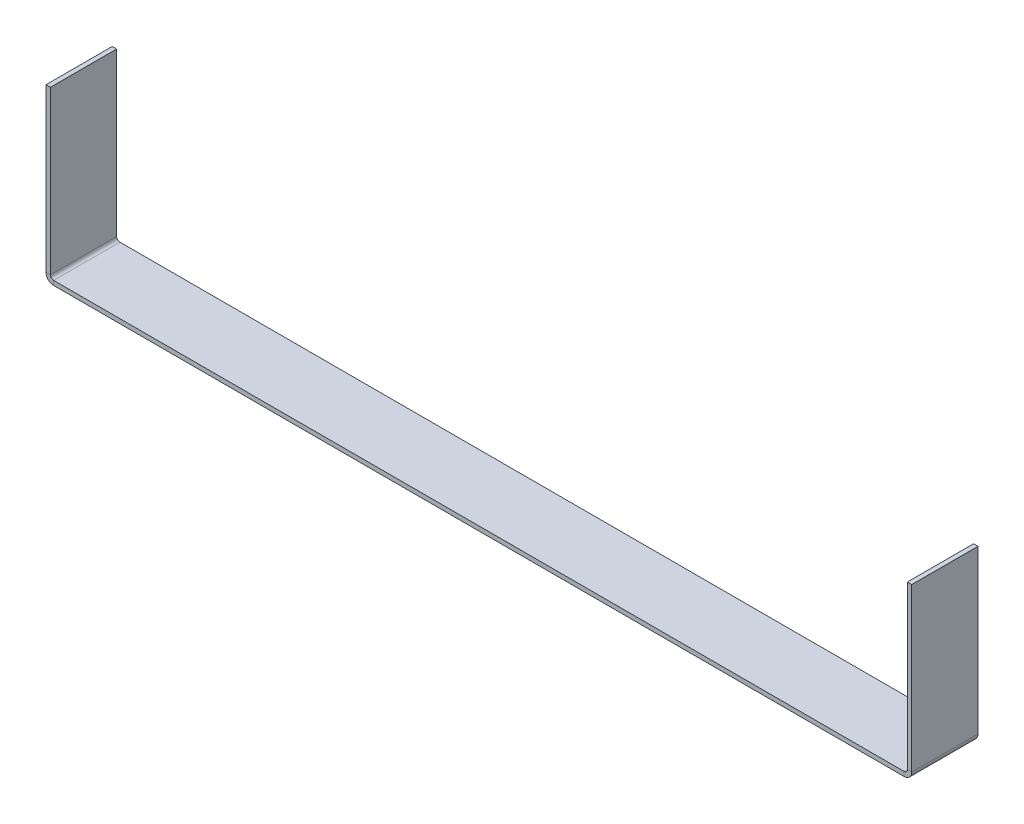
ISO-10303-21;
HEADER;
FILE_DESCRIPTION(('STEP AP214'),'2;1');
FILE_NAME('part.step','',(''),(''),'','','');
FILE_SCHEMA(('AUTOMOTIVE_DESIGN { 1 0 10303 214 1 1 1 1 }'));
ENDSEC;
DATA;
#1=APPLICATION_CONTEXT('core data for automotive mechanical design processes');
#2=APPLICATION_PROTOCOL_DEFINITION('international standard','automotive_design',2000,#1);
#3=PRODUCT_CONTEXT('',#1,'mechanical');
#4=PRODUCT('Part','Part','',(#3));
#5=PRODUCT_RELATED_PRODUCT_CATEGORY('part','',(#4));
#6=PRODUCT_DEFINITION_FORMATION('','',#4);
#7=PRODUCT_DEFINITION_CONTEXT('part definition',#1,'design');
#8=PRODUCT_DEFINITION('design','',#6,#7);
#9=PRODUCT_DEFINITION_SHAPE('','',#8);
#10=(LENGTH_UNIT() NAMED_UNIT(*) SI_UNIT(.MILLI.,.METRE.));
#11=(NAMED_UNIT(*) PLANE_ANGLE_UNIT() SI_UNIT($,.RADIAN.));
#12=(NAMED_UNIT(*) SI_UNIT($,.STERADIAN.) SOLID_ANGLE_UNIT());
#13=UNCERTAINTY_MEASURE_WITH_UNIT(LENGTH_MEASURE(1.E-05),#10,'distance_accuracy_value','');
#14=(GEOMETRIC_REPRESENTATION_CONTEXT(3) GLOBAL_UNCERTAINTY_ASSIGNED_CONTEXT((#13)) GLOBAL_UNIT_ASSIGNED_CONTEXT((#10,
#11,#12)) REPRESENTATION_CONTEXT('',''));
#15=CARTESIAN_POINT('',(0.,0.,0.));
#16=DIRECTION('',(0.,0.,1.));
#17=DIRECTION('',(1.,0.,0.));
#18=AXIS2_PLACEMENT_3D('',#15,#16,#17);
#19=CARTESIAN_POINT('',(0.,-1.,-15.));
#20=DIRECTION('',(0.,0.,1.));
#21=DIRECTION('',(1.,0.,0.));
#22=AXIS2_PLACEMENT_3D('',#19,#20,#21);
#23=PLANE('',#22);
#24=DIRECTION('',(0.,-1.,0.));
#25=VECTOR('',#24,1.);
#26=CARTESIAN_POINT('',(194.2634,0.,-15.));
#27=LINE('',#26,#25);
#28=CARTESIAN_POINT('',(194.2634,0.,-15.));
#29=VERTEX_POINT('',#28);
#30=CARTESIAN_POINT('',(194.2634,-0.999999999999997,-15.));
#31=VERTEX_POINT('',#30);
#32=EDGE_CURVE('E217',#29,#31,#27,.T.);
#33=ORIENTED_EDGE('',*,*,#32,.T.);
#34=DIRECTION('',(1.,0.,0.));
#35=VECTOR('',#34,1.);
#36=CARTESIAN_POINT('',(0.,-1.,-15.));
#37=LINE('',#36,#35);
#38=CARTESIAN_POINT('',(1.7366,-1.,-15.));
#39=VERTEX_POINT('',#38);
#40=EDGE_CURVE('E86',#39,#31,#37,.T.);
#41=ORIENTED_EDGE('',*,*,#40,.F.);
#42=DIRECTION('',(0.,-1.,0.));
#43=VECTOR('',#42,1.);
#44=CARTESIAN_POINT('',(1.7366,0.,-15.));
#45=LINE('',#44,#43);
#46=CARTESIAN_POINT('',(1.7366,0.,-15.));
#47=VERTEX_POINT('',#46);
#48=EDGE_CURVE('E278',#47,#39,#45,.T.);
#49=ORIENTED_EDGE('',*,*,#48,.F.);
#50=DIRECTION('',(1.,0.,0.));
#51=VECTOR('',#50,1.);
#52=CARTESIAN_POINT('',(0.,0.,-15.));
#53=LINE('',#52,#51);
#54=EDGE_CURVE('E281',#47,#29,#53,.T.);
#55=ORIENTED_EDGE('',*,*,#54,.T.);
#56=EDGE_LOOP('',(#33,#41,#49,#55));
#57=FACE_BOUND('',#56,.T.);
#58=ADVANCED_FACE('F78',(#57),#23,.F.);
#59=CARTESIAN_POINT('',(0.,-1.,0.));
#60=DIRECTION('',(0.,1.,0.));
#61=DIRECTION('',(0.,0.,1.));
#62=AXIS2_PLACEMENT_3D('',#59,#60,#61);
#63=PLANE('',#62);
#64=DIRECTION('',(0.,0.,-1.));
#65=VECTOR('',#64,1.);
#66=CARTESIAN_POINT('',(194.2634,-0.999999999999997,-15.));
#67=LINE('',#66,#65);
#68=CARTESIAN_POINT('',(194.2634,-1.,0.));
#69=VERTEX_POINT('',#68);
#70=EDGE_CURVE('E211',#31,#69,#67,.F.);
#71=ORIENTED_EDGE('',*,*,#70,.T.);
#72=DIRECTION('',(1.,0.,0.));
#73=VECTOR('',#72,1.);
#74=CARTESIAN_POINT('',(0.,-1.,0.));
#75=LINE('',#74,#73);
#76=CARTESIAN_POINT('',(1.7366,-1.,0.));
#77=VERTEX_POINT('',#76);
#78=EDGE_CURVE('E13',#77,#69,#75,.T.);
#79=ORIENTED_EDGE('',*,*,#78,.F.);
#80=DIRECTION('',(0.,0.,1.));
#81=VECTOR('',#80,1.);
#82=CARTESIAN_POINT('',(1.7366,-1.,0.));
#83=LINE('',#82,#81);
#84=EDGE_CURVE('E263',#77,#39,#83,.F.);
#85=ORIENTED_EDGE('',*,*,#84,.T.);
#86=ORIENTED_EDGE('',*,*,#40,.T.);
#87=EDGE_LOOP('',(#71,#79,#85,#86));
#88=FACE_BOUND('',#87,.T.);
#89=ADVANCED_FACE('F350',(#88),#63,.F.);
#90=CARTESIAN_POINT('',(0.,0.,0.));
#91=DIRECTION('',(0.,1.,0.));
#92=DIRECTION('',(0.,0.,1.));
#93=AXIS2_PLACEMENT_3D('',#90,#91,#92);
#94=PLANE('',#93);
#95=DIRECTION('',(1.,0.,0.));
#96=VECTOR('',#95,1.);
#97=CARTESIAN_POINT('',(0.,0.,0.));
#98=LINE('',#97,#96);
#99=CARTESIAN_POINT('',(1.7366,0.,0.));
#100=VERTEX_POINT('',#99);
#101=CARTESIAN_POINT('',(194.2634,0.,0.));
#102=VERTEX_POINT('',#101);
#103=EDGE_CURVE('E81',#100,#102,#98,.T.);
#104=ORIENTED_EDGE('',*,*,#103,.T.);
#105=DIRECTION('',(0.,0.,-1.));
#106=VECTOR('',#105,1.);
#107=CARTESIAN_POINT('',(194.2634,0.,-15.));
#108=LINE('',#107,#106);
#109=EDGE_CURVE('E94',#29,#102,#108,.F.);
#110=ORIENTED_EDGE('',*,*,#109,.F.);
#111=ORIENTED_EDGE('',*,*,#54,.F.);
#112=DIRECTION('',(0.,0.,1.));
#113=VECTOR('',#112,1.);
#114=CARTESIAN_POINT('',(1.7366,0.,0.));
#115=LINE('',#114,#113);
#116=EDGE_CURVE('E99',#100,#47,#115,.F.);
#117=ORIENTED_EDGE('',*,*,#116,.F.);
#118=EDGE_LOOP('',(#104,#110,#111,#117));
#119=FACE_BOUND('',#118,.T.);
#120=ADVANCED_FACE('F286',(#119),#94,.T.);
#121=CARTESIAN_POINT('',(0.,-1.,0.));
#122=DIRECTION('',(0.,0.,1.));
#123=DIRECTION('',(1.,0.,0.));
#124=AXIS2_PLACEMENT_3D('',#121,#122,#123);
#125=PLANE('',#124);
#126=DIRECTION('',(0.,-1.,0.));
#127=VECTOR('',#126,1.);
#128=CARTESIAN_POINT('',(194.2634,0.,0.));
#129=LINE('',#128,#127);
#130=EDGE_CURVE('E227',#102,#69,#129,.T.);
#131=ORIENTED_EDGE('',*,*,#130,.F.);
#132=ORIENTED_EDGE('',*,*,#103,.F.);
#133=DIRECTION('',(0.,-1.,0.));
#134=VECTOR('',#133,1.);
#135=CARTESIAN_POINT('',(1.7366,0.,0.));
#136=LINE('',#135,#134);
#137=EDGE_CURVE('E269',#100,#77,#136,.T.);
#138=ORIENTED_EDGE('',*,*,#137,.T.);
#139=ORIENTED_EDGE('',*,*,#78,.T.);
#140=EDGE_LOOP('',(#131,#132,#138,#139));
#141=FACE_BOUND('',#140,.T.);
#142=ADVANCED_FACE('F358',(#141),#125,.T.);
#143=CARTESIAN_POINT('',(1.7366,0.7366,-15.));
#144=DIRECTION('',(0.,0.,-1.));
#145=DIRECTION('',(-1.,0.,0.));
#146=AXIS2_PLACEMENT_3D('',#143,#144,#145);
#147=PLANE('',#146);
#148=DIRECTION('',(1.,0.,0.));
#149=VECTOR('',#148,1.);
#150=CARTESIAN_POINT('',(0.,0.736599999999994,-15.));
#151=LINE('',#150,#149);
#152=CARTESIAN_POINT('',(0.999999999999997,0.736599999999997,-15.));
#153=VERTEX_POINT('',#152);
#154=CARTESIAN_POINT('',(0.,0.736599999999994,-15.));
#155=VERTEX_POINT('',#154);
#156=EDGE_CURVE('E230',#153,#155,#151,.F.);
#157=ORIENTED_EDGE('',*,*,#156,.F.);
#158=CARTESIAN_POINT('',(1.7366,0.7366,-15.));
#159=DIRECTION('',(0.,0.,1.));
#160=DIRECTION('',(1.,0.,0.));
#161=AXIS2_PLACEMENT_3D('',#158,#159,#160);
#162=CIRCLE('',#161,0.7366);
#163=EDGE_CURVE('E272',#47,#153,#162,.F.);
#164=ORIENTED_EDGE('',*,*,#163,.F.);
#165=ORIENTED_EDGE('',*,*,#48,.T.);
#166=CARTESIAN_POINT('',(1.7366,0.7366,-15.));
#167=DIRECTION('',(0.,0.,1.));
#168=DIRECTION('',(1.,0.,0.));
#169=AXIS2_PLACEMENT_3D('',#166,#167,#168);
#170=CIRCLE('',#169,1.7366);
#171=EDGE_CURVE('E265',#39,#155,#170,.F.);
#172=ORIENTED_EDGE('',*,*,#171,.T.);
#173=EDGE_LOOP('',(#157,#164,#165,#172));
#174=FACE_BOUND('',#173,.T.);
#175=ADVANCED_FACE('F313',(#174),#147,.T.);
#176=CARTESIAN_POINT('',(1.7366,0.7366,0.));
#177=DIRECTION('',(0.,0.,-1.));
#178=DIRECTION('',(-1.,0.,0.));
#179=AXIS2_PLACEMENT_3D('',#176,#177,#178);
#180=PLANE('',#179);
#181=CARTESIAN_POINT('',(1.7366,0.7366,0.));
#182=DIRECTION('',(0.,0.,1.));
#183=DIRECTION('',(1.,0.,0.));
#184=AXIS2_PLACEMENT_3D('',#181,#182,#183);
#185=CIRCLE('',#184,0.7366);
#186=CARTESIAN_POINT('',(0.999999999999997,0.736599999999997,0.));
#187=VERTEX_POINT('',#186);
#188=EDGE_CURVE('E236',#187,#100,#185,.T.);
#189=ORIENTED_EDGE('',*,*,#188,.F.);
#190=DIRECTION('',(1.,0.,0.));
#191=VECTOR('',#190,1.);
#192=CARTESIAN_POINT('',(0.999999999999997,0.736599999999997,0.));
#193=LINE('',#192,#191);
#194=CARTESIAN_POINT('',(0.,0.736599999999994,0.));
#195=VERTEX_POINT('',#194);
#196=EDGE_CURVE('E256',#187,#195,#193,.F.);
#197=ORIENTED_EDGE('',*,*,#196,.T.);
#198=CARTESIAN_POINT('',(1.7366,0.7366,0.));
#199=DIRECTION('',(0.,0.,1.));
#200=DIRECTION('',(1.,0.,0.));
#201=AXIS2_PLACEMENT_3D('',#198,#199,#200);
#202=CIRCLE('',#201,1.7366);
#203=EDGE_CURVE('E266',#195,#77,#202,.T.);
#204=ORIENTED_EDGE('',*,*,#203,.T.);
#205=ORIENTED_EDGE('',*,*,#137,.F.);
#206=EDGE_LOOP('',(#189,#197,#204,#205));
#207=FACE_BOUND('',#206,.T.);
#208=ADVANCED_FACE('F361',(#207),#180,.F.);
#209=CARTESIAN_POINT('',(1.7366,0.7366,0.));
#210=DIRECTION('',(0.,0.,1.));
#211=DIRECTION('',(-1.,0.,0.));
#212=AXIS2_PLACEMENT_3D('',#209,#210,#211);
#213=CYLINDRICAL_SURFACE('',#212,1.7366);
#214=ORIENTED_EDGE('',*,*,#84,.F.);
#215=ORIENTED_EDGE('',*,*,#203,.F.);
#216=DIRECTION('',(0.,0.,1.));
#217=VECTOR('',#216,1.);
#218=CARTESIAN_POINT('',(0.,0.736599999999994,-15.));
#219=LINE('',#218,#217);
#220=EDGE_CURVE('E254',#195,#155,#219,.F.);
#221=ORIENTED_EDGE('',*,*,#220,.T.);
#222=ORIENTED_EDGE('',*,*,#171,.F.);
#223=EDGE_LOOP('',(#214,#215,#221,#222));
#224=FACE_BOUND('',#223,.T.);
#225=ADVANCED_FACE('F316',(#224),#213,.T.);
#226=CARTESIAN_POINT('',(1.7366,0.7366,0.));
#227=DIRECTION('',(0.,0.,1.));
#228=DIRECTION('',(-1.,0.,0.));
#229=AXIS2_PLACEMENT_3D('',#226,#227,#228);
#230=CYLINDRICAL_SURFACE('',#229,0.7366);
#231=ORIENTED_EDGE('',*,*,#116,.T.);
#232=ORIENTED_EDGE('',*,*,#163,.T.);
#233=DIRECTION('',(0.,0.,1.));
#234=VECTOR('',#233,1.);
#235=CARTESIAN_POINT('',(0.999999999999997,0.736599999999997,-15.));
#236=LINE('',#235,#234);
#237=EDGE_CURVE('E259',#153,#187,#236,.T.);
#238=ORIENTED_EDGE('',*,*,#237,.T.);
#239=ORIENTED_EDGE('',*,*,#188,.T.);
#240=EDGE_LOOP('',(#231,#232,#238,#239));
#241=FACE_BOUND('',#240,.T.);
#242=ADVANCED_FACE('F337',(#241),#230,.F.);
#243=CARTESIAN_POINT('',(0.,0.,-15.));
#244=DIRECTION('',(0.,0.,1.));
#245=DIRECTION('',(1.,0.,0.));
#246=AXIS2_PLACEMENT_3D('',#243,#244,#245);
#247=PLANE('',#246);
#248=ORIENTED_EDGE('',*,*,#156,.T.);
#249=DIRECTION('',(0.,-1.,0.));
#250=VECTOR('',#249,1.);
#251=CARTESIAN_POINT('',(0.,0.,-15.));
#252=LINE('',#251,#250);
#253=CARTESIAN_POINT('',(-1.30930550206618E-13,37.5,-15.));
#254=VERTEX_POINT('',#253);
#255=EDGE_CURVE('E244',#254,#155,#252,.T.);
#256=ORIENTED_EDGE('',*,*,#255,.F.);
#257=DIRECTION('',(1.,0.,0.));
#258=VECTOR('',#257,1.);
#259=CARTESIAN_POINT('',(-1.30930550206618E-13,37.5,-15.));
#260=LINE('',#259,#258);
#261=CARTESIAN_POINT('',(0.999999999999869,37.5,-15.));
#262=VERTEX_POINT('',#261);
#263=EDGE_CURVE('E237',#254,#262,#260,.T.);
#264=ORIENTED_EDGE('',*,*,#263,.T.);
#265=DIRECTION('',(0.,1.,0.));
#266=VECTOR('',#265,1.);
#267=CARTESIAN_POINT('',(1.,0.,-15.));
#268=LINE('',#267,#266);
#269=EDGE_CURVE('E251',#262,#153,#268,.F.);
#270=ORIENTED_EDGE('',*,*,#269,.T.);
#271=EDGE_LOOP('',(#248,#256,#264,#270));
#272=FACE_BOUND('',#271,.T.);
#273=ADVANCED_FACE('F334',(#272),#247,.F.);
#274=CARTESIAN_POINT('',(-1.30971622436249E-13,37.5,0.));
#275=DIRECTION('',(0.,0.,-1.));
#276=DIRECTION('',(-1.,0.,0.));
#277=AXIS2_PLACEMENT_3D('',#274,#275,#276);
#278=PLANE('',#277);
#279=ORIENTED_EDGE('',*,*,#196,.F.);
#280=DIRECTION('',(0.,-1.,0.));
#281=VECTOR('',#280,1.);
#282=CARTESIAN_POINT('',(0.999999999999869,37.5,0.));
#283=LINE('',#282,#281);
#284=CARTESIAN_POINT('',(0.999999999999869,37.5,0.));
#285=VERTEX_POINT('',#284);
#286=EDGE_CURVE('E249',#187,#285,#283,.F.);
#287=ORIENTED_EDGE('',*,*,#286,.T.);
#288=DIRECTION('',(1.,0.,0.));
#289=VECTOR('',#288,1.);
#290=CARTESIAN_POINT('',(-1.30971622436249E-13,37.5,0.));
#291=LINE('',#290,#289);
#292=CARTESIAN_POINT('',(-1.30930550206618E-13,37.5,0.));
#293=VERTEX_POINT('',#292);
#294=EDGE_CURVE('E233',#293,#285,#291,.T.);
#295=ORIENTED_EDGE('',*,*,#294,.F.);
#296=DIRECTION('',(0.,1.,0.));
#297=VECTOR('',#296,1.);
#298=CARTESIAN_POINT('',(0.,0.,0.));
#299=LINE('',#298,#297);
#300=EDGE_CURVE('E242',#195,#293,#299,.T.);
#301=ORIENTED_EDGE('',*,*,#300,.F.);
#302=EDGE_LOOP('',(#279,#287,#295,#301));
#303=FACE_BOUND('',#302,.T.);
#304=ADVANCED_FACE('F325',(#303),#278,.F.);
#305=CARTESIAN_POINT('',(0.,0.,0.));
#306=DIRECTION('',(1.,0.,0.));
#307=DIRECTION('',(0.,1.,0.));
#308=AXIS2_PLACEMENT_3D('',#305,#306,#307);
#309=PLANE('',#308);
#310=ORIENTED_EDGE('',*,*,#220,.F.);
#311=ORIENTED_EDGE('',*,*,#300,.T.);
#312=DIRECTION('',(0.,0.,-1.));
#313=VECTOR('',#312,1.);
#314=CARTESIAN_POINT('',(-1.30930550206618E-13,37.5,0.));
#315=LINE('',#314,#313);
#316=EDGE_CURVE('E240',#293,#254,#315,.T.);
#317=ORIENTED_EDGE('',*,*,#316,.T.);
#318=ORIENTED_EDGE('',*,*,#255,.T.);
#319=EDGE_LOOP('',(#310,#311,#317,#318));
#320=FACE_BOUND('',#319,.T.);
#321=ADVANCED_FACE('F320',(#320),#309,.F.);
#322=CARTESIAN_POINT('',(1.,0.,0.));
#323=DIRECTION('',(1.,0.,0.));
#324=DIRECTION('',(0.,1.,0.));
#325=AXIS2_PLACEMENT_3D('',#322,#323,#324);
#326=PLANE('',#325);
#327=ORIENTED_EDGE('',*,*,#286,.F.);
#328=ORIENTED_EDGE('',*,*,#237,.F.);
#329=ORIENTED_EDGE('',*,*,#269,.F.);
#330=DIRECTION('',(0.,0.,1.));
#331=VECTOR('',#330,1.);
#332=CARTESIAN_POINT('',(0.999999999999869,37.5,-15.));
#333=LINE('',#332,#331);
#334=EDGE_CURVE('E247',#285,#262,#333,.F.);
#335=ORIENTED_EDGE('',*,*,#334,.F.);
#336=EDGE_LOOP('',(#327,#328,#329,#335));
#337=FACE_BOUND('',#336,.T.);
#338=ADVANCED_FACE('F340',(#337),#326,.T.);
#339=CARTESIAN_POINT('',(-1.30971622436249E-13,37.5,-15.));
#340=DIRECTION('',(0.,-1.,0.));
#341=DIRECTION('',(1.,0.,0.));
#342=AXIS2_PLACEMENT_3D('',#339,#340,#341);
#343=PLANE('',#342);
#344=ORIENTED_EDGE('',*,*,#334,.T.);
#345=ORIENTED_EDGE('',*,*,#263,.F.);
#346=ORIENTED_EDGE('',*,*,#316,.F.);
#347=ORIENTED_EDGE('',*,*,#294,.T.);
#348=EDGE_LOOP('',(#344,#345,#346,#347));
#349=FACE_BOUND('',#348,.T.);
#350=ADVANCED_FACE('F331',(#349),#343,.F.);
#351=CARTESIAN_POINT('',(194.2634,0.736600000000007,0.));
#352=DIRECTION('',(0.,0.,1.));
#353=DIRECTION('',(1.,0.,0.));
#354=AXIS2_PLACEMENT_3D('',#351,#352,#353);
#355=PLANE('',#354);
#356=DIRECTION('',(-1.,0.,0.));
#357=VECTOR('',#356,1.);
#358=CARTESIAN_POINT('',(196.,0.7366,0.));
#359=LINE('',#358,#357);
#360=CARTESIAN_POINT('',(195.,0.736600000000004,0.));
#361=VERTEX_POINT('',#360);
#362=CARTESIAN_POINT('',(196.,0.7366,0.));
#363=VERTEX_POINT('',#362);
#364=EDGE_CURVE('E193',#361,#363,#359,.F.);
#365=ORIENTED_EDGE('',*,*,#364,.F.);
#366=CARTESIAN_POINT('',(194.2634,0.736600000000007,0.));
#367=DIRECTION('',(0.,0.,-1.));
#368=DIRECTION('',(-1.,0.,0.));
#369=AXIS2_PLACEMENT_3D('',#366,#367,#368);
#370=CIRCLE('',#369,0.736600000000004);
#371=EDGE_CURVE('E220',#102,#361,#370,.F.);
#372=ORIENTED_EDGE('',*,*,#371,.F.);
#373=ORIENTED_EDGE('',*,*,#130,.T.);
#374=CARTESIAN_POINT('',(194.2634,0.736600000000007,0.));
#375=DIRECTION('',(0.,0.,-1.));
#376=DIRECTION('',(-1.,0.,0.));
#377=AXIS2_PLACEMENT_3D('',#374,#375,#376);
#378=CIRCLE('',#377,1.7366);
#379=EDGE_CURVE('E213',#69,#363,#378,.F.);
#380=ORIENTED_EDGE('',*,*,#379,.T.);
#381=EDGE_LOOP('',(#365,#372,#373,#380));
#382=FACE_BOUND('',#381,.T.);
#383=ADVANCED_FACE('F295',(#382),#355,.T.);
#384=CARTESIAN_POINT('',(194.2634,0.736600000000007,-15.));
#385=DIRECTION('',(0.,0.,1.));
#386=DIRECTION('',(1.,0.,0.));
#387=AXIS2_PLACEMENT_3D('',#384,#385,#386);
#388=PLANE('',#387);
#389=CARTESIAN_POINT('',(194.2634,0.736600000000007,-15.));
#390=DIRECTION('',(0.,0.,-1.));
#391=DIRECTION('',(-1.,0.,0.));
#392=AXIS2_PLACEMENT_3D('',#389,#390,#391);
#393=CIRCLE('',#392,0.736600000000004);
#394=CARTESIAN_POINT('',(195.,0.736600000000004,-15.));
#395=VERTEX_POINT('',#394);
#396=EDGE_CURVE('E224',#395,#29,#393,.T.);
#397=ORIENTED_EDGE('',*,*,#396,.F.);
#398=DIRECTION('',(-1.,0.,0.));
#399=VECTOR('',#398,1.);
#400=CARTESIAN_POINT('',(195.,0.736600000000004,-15.));
#401=LINE('',#400,#399);
#402=CARTESIAN_POINT('',(196.,0.7366,-15.));
#403=VERTEX_POINT('',#402);
#404=EDGE_CURVE('E205',#395,#403,#401,.F.);
#405=ORIENTED_EDGE('',*,*,#404,.T.);
#406=CARTESIAN_POINT('',(194.2634,0.736600000000007,-15.));
#407=DIRECTION('',(0.,0.,-1.));
#408=DIRECTION('',(-1.,0.,0.));
#409=AXIS2_PLACEMENT_3D('',#406,#407,#408);
#410=CIRCLE('',#409,1.7366);
#411=EDGE_CURVE('E214',#403,#31,#410,.T.);
#412=ORIENTED_EDGE('',*,*,#411,.T.);
#413=ORIENTED_EDGE('',*,*,#32,.F.);
#414=EDGE_LOOP('',(#397,#405,#412,#413));
#415=FACE_BOUND('',#414,.T.);
#416=ADVANCED_FACE('F307',(#415),#388,.F.);
#417=CARTESIAN_POINT('',(194.2634,0.736600000000007,-15.));
#418=DIRECTION('',(0.,0.,-1.));
#419=DIRECTION('',(1.,0.,0.));
#420=AXIS2_PLACEMENT_3D('',#417,#418,#419);
#421=CYLINDRICAL_SURFACE('',#420,1.7366);
#422=ORIENTED_EDGE('',*,*,#70,.F.);
#423=ORIENTED_EDGE('',*,*,#411,.F.);
#424=DIRECTION('',(0.,0.,-1.));
#425=VECTOR('',#424,1.);
#426=CARTESIAN_POINT('',(196.,0.7366,0.));
#427=LINE('',#426,#425);
#428=EDGE_CURVE('E203',#403,#363,#427,.F.);
#429=ORIENTED_EDGE('',*,*,#428,.T.);
#430=ORIENTED_EDGE('',*,*,#379,.F.);
#431=EDGE_LOOP('',(#422,#423,#429,#430));
#432=FACE_BOUND('',#431,.T.);
#433=ADVANCED_FACE('F299',(#432),#421,.T.);
#434=CARTESIAN_POINT('',(194.2634,0.736600000000007,-15.));
#435=DIRECTION('',(0.,0.,-1.));
#436=DIRECTION('',(1.,0.,0.));
#437=AXIS2_PLACEMENT_3D('',#434,#435,#436);
#438=CYLINDRICAL_SURFACE('',#437,0.736600000000004);
#439=ORIENTED_EDGE('',*,*,#109,.T.);
#440=ORIENTED_EDGE('',*,*,#371,.T.);
#441=DIRECTION('',(0.,0.,-1.));
#442=VECTOR('',#441,1.);
#443=CARTESIAN_POINT('',(195.,0.736600000000004,0.));
#444=LINE('',#443,#442);
#445=EDGE_CURVE('E208',#361,#395,#444,.T.);
#446=ORIENTED_EDGE('',*,*,#445,.T.);
#447=ORIENTED_EDGE('',*,*,#396,.T.);
#448=EDGE_LOOP('',(#439,#440,#446,#447));
#449=FACE_BOUND('',#448,.T.);
#450=ADVANCED_FACE('F291',(#449),#438,.F.);
#451=CARTESIAN_POINT('',(196.,37.5,-15.));
#452=DIRECTION('',(0.,0.,1.));
#453=DIRECTION('',(1.,0.,0.));
#454=AXIS2_PLACEMENT_3D('',#451,#452,#453);
#455=PLANE('',#454);
#456=ORIENTED_EDGE('',*,*,#404,.F.);
#457=DIRECTION('',(0.,-1.,0.));
#458=VECTOR('',#457,1.);
#459=CARTESIAN_POINT('',(195.,37.5,-15.));
#460=LINE('',#459,#458);
#461=CARTESIAN_POINT('',(195.,37.5,-15.));
#462=VERTEX_POINT('',#461);
#463=EDGE_CURVE('E201',#395,#462,#460,.F.);
#464=ORIENTED_EDGE('',*,*,#463,.T.);
#465=DIRECTION('',(-1.,0.,0.));
#466=VECTOR('',#465,1.);
#467=CARTESIAN_POINT('',(196.,37.5,-15.));
#468=LINE('',#467,#466);
#469=CARTESIAN_POINT('',(196.,37.5,-15.));
#470=VERTEX_POINT('',#469);
#471=EDGE_CURVE('E189',#470,#462,#468,.T.);
#472=ORIENTED_EDGE('',*,*,#471,.F.);
#473=DIRECTION('',(0.,1.,0.));
#474=VECTOR('',#473,1.);
#475=CARTESIAN_POINT('',(196.,-7.28837190760612E-13,-15.));
#476=LINE('',#475,#474);
#477=EDGE_CURVE('E176',#403,#470,#476,.T.);
#478=ORIENTED_EDGE('',*,*,#477,.F.);
#479=EDGE_LOOP('',(#456,#464,#472,#478));
#480=FACE_BOUND('',#479,.T.);
#481=ADVANCED_FACE('F302',(#480),#455,.F.);
#482=CARTESIAN_POINT('',(196.,0.,0.));
#483=DIRECTION('',(0.,0.,-1.));
#484=DIRECTION('',(-1.,0.,0.));
#485=AXIS2_PLACEMENT_3D('',#482,#483,#484);
#486=PLANE('',#485);
#487=ORIENTED_EDGE('',*,*,#364,.T.);
#488=DIRECTION('',(0.,-1.,0.));
#489=VECTOR('',#488,1.);
#490=CARTESIAN_POINT('',(196.,-7.28837190760612E-13,0.));
#491=LINE('',#490,#489);
#492=CARTESIAN_POINT('',(196.,37.5,0.));
#493=VERTEX_POINT('',#492);
#494=EDGE_CURVE('E174',#493,#363,#491,.T.);
#495=ORIENTED_EDGE('',*,*,#494,.F.);
#496=DIRECTION('',(-1.,0.,0.));
#497=VECTOR('',#496,1.);
#498=CARTESIAN_POINT('',(196.,37.5,0.));
#499=LINE('',#498,#497);
#500=CARTESIAN_POINT('',(195.,37.5,0.));
#501=VERTEX_POINT('',#500);
#502=EDGE_CURVE('E182',#493,#501,#499,.T.);
#503=ORIENTED_EDGE('',*,*,#502,.T.);
#504=DIRECTION('',(0.,1.,0.));
#505=VECTOR('',#504,1.);
#506=CARTESIAN_POINT('',(195.,0.,0.));
#507=LINE('',#506,#505);
#508=EDGE_CURVE('E198',#501,#361,#507,.F.);
#509=ORIENTED_EDGE('',*,*,#508,.T.);
#510=EDGE_LOOP('',(#487,#495,#503,#509));
#511=FACE_BOUND('',#510,.T.);
#512=ADVANCED_FACE('F192',(#511),#486,.F.);
#513=CARTESIAN_POINT('',(196.,-7.28837190760612E-13,0.));
#514=DIRECTION('',(-1.,0.,0.));
#515=DIRECTION('',(0.,-1.,0.));
#516=AXIS2_PLACEMENT_3D('',#513,#514,#515);
#517=PLANE('',#516);
#518=ORIENTED_EDGE('',*,*,#428,.F.);
#519=ORIENTED_EDGE('',*,*,#477,.T.);
#520=DIRECTION('',(0.,0.,1.));
#521=VECTOR('',#520,1.);
#522=CARTESIAN_POINT('',(196.,37.5,0.));
#523=LINE('',#522,#521);
#524=EDGE_CURVE('E169',#470,#493,#523,.T.);
#525=ORIENTED_EDGE('',*,*,#524,.T.);
#526=ORIENTED_EDGE('',*,*,#494,.T.);
#527=EDGE_LOOP('',(#518,#519,#525,#526));
#528=FACE_BOUND('',#527,.T.);
#529=ADVANCED_FACE('F172',(#528),#517,.F.);
#530=CARTESIAN_POINT('',(195.,-7.25345709421769E-13,0.));
#531=DIRECTION('',(-1.,0.,0.));
#532=DIRECTION('',(0.,-1.,0.));
#533=AXIS2_PLACEMENT_3D('',#530,#531,#532);
#534=PLANE('',#533);
#535=ORIENTED_EDGE('',*,*,#463,.F.);
#536=ORIENTED_EDGE('',*,*,#445,.F.);
#537=ORIENTED_EDGE('',*,*,#508,.F.);
#538=DIRECTION('',(0.,0.,-1.));
#539=VECTOR('',#538,1.);
#540=CARTESIAN_POINT('',(195.,37.5,0.));
#541=LINE('',#540,#539);
#542=EDGE_CURVE('E185',#462,#501,#541,.F.);
#543=ORIENTED_EDGE('',*,*,#542,.F.);
#544=EDGE_LOOP('',(#535,#536,#537,#543));
#545=FACE_BOUND('',#544,.T.);
#546=ADVANCED_FACE('F305',(#545),#534,.T.);
#547=CARTESIAN_POINT('',(196.,37.5,0.));
#548=DIRECTION('',(0.,-1.,0.));
#549=DIRECTION('',(1.,0.,0.));
#550=AXIS2_PLACEMENT_3D('',#547,#548,#549);
#551=PLANE('',#550);
#552=ORIENTED_EDGE('',*,*,#542,.T.);
#553=ORIENTED_EDGE('',*,*,#502,.F.);
#554=ORIENTED_EDGE('',*,*,#524,.F.);
#555=ORIENTED_EDGE('',*,*,#471,.T.);
#556=EDGE_LOOP('',(#552,#553,#554,#555));
#557=FACE_BOUND('',#556,.T.);
#558=ADVANCED_FACE('F183',(#557),#551,.F.);
#559=CLOSED_SHELL('',(#58,#89,#120,#142,#175,#208,#225,#242,#273,#304,#321,#338,#350,#383,#416,
#433,#450,#481,#512,#529,#546,#558));
#560=MANIFOLD_SOLID_BREP('B2',#559);
#561=ADVANCED_BREP_SHAPE_REPRESENTATION('',(#18,#560),#14);
#562=SHAPE_DEFINITION_REPRESENTATION(#9,#561);
ENDSEC;
END-ISO-10303-21;
